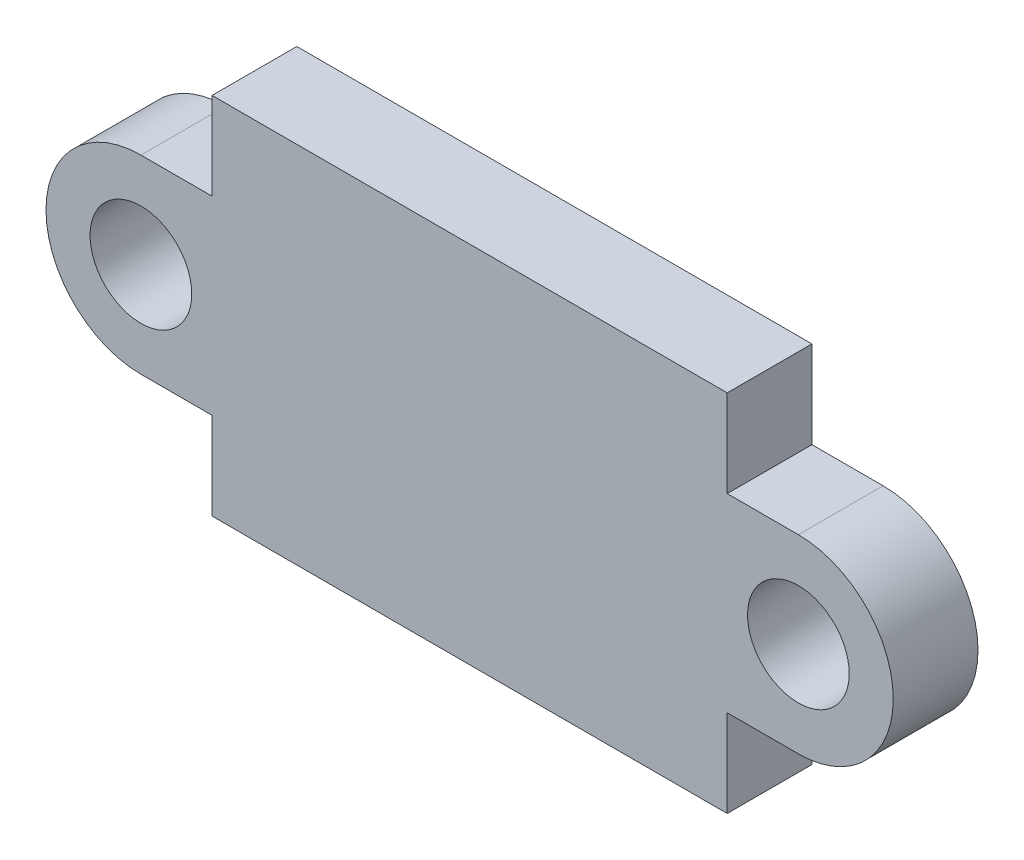
ISO-10303-21;
HEADER;
FILE_DESCRIPTION(('STEP AP214'),'2;1');
FILE_NAME('part.step','',(''),(''),'','','');
FILE_SCHEMA(('AUTOMOTIVE_DESIGN { 1 0 10303 214 1 1 1 1 }'));
ENDSEC;
DATA;
#1=APPLICATION_CONTEXT('core data for automotive mechanical design processes');
#2=APPLICATION_PROTOCOL_DEFINITION('international standard','automotive_design',2000,#1);
#3=PRODUCT_CONTEXT('',#1,'mechanical');
#4=PRODUCT('Part','Part','',(#3));
#5=PRODUCT_RELATED_PRODUCT_CATEGORY('part','',(#4));
#6=PRODUCT_DEFINITION_FORMATION('','',#4);
#7=PRODUCT_DEFINITION_CONTEXT('part definition',#1,'design');
#8=PRODUCT_DEFINITION('design','',#6,#7);
#9=PRODUCT_DEFINITION_SHAPE('','',#8);
#10=(LENGTH_UNIT() NAMED_UNIT(*) SI_UNIT(.MILLI.,.METRE.));
#11=(NAMED_UNIT(*) PLANE_ANGLE_UNIT() SI_UNIT($,.RADIAN.));
#12=(NAMED_UNIT(*) SI_UNIT($,.STERADIAN.) SOLID_ANGLE_UNIT());
#13=UNCERTAINTY_MEASURE_WITH_UNIT(LENGTH_MEASURE(1.E-05),#10,'distance_accuracy_value','');
#14=(GEOMETRIC_REPRESENTATION_CONTEXT(3) GLOBAL_UNCERTAINTY_ASSIGNED_CONTEXT((#13)) GLOBAL_UNIT_ASSIGNED_CONTEXT((#10,
#11,#12)) REPRESENTATION_CONTEXT('',''));
#15=CARTESIAN_POINT('',(0.,0.,0.));
#16=DIRECTION('',(0.,0.,1.));
#17=DIRECTION('',(1.,0.,0.));
#18=AXIS2_PLACEMENT_3D('',#15,#16,#17);
#19=CARTESIAN_POINT('',(-7.6,-5.375,2.5));
#20=DIRECTION('',(0.,1.,0.));
#21=DIRECTION('',(0.,0.,1.));
#22=AXIS2_PLACEMENT_3D('',#19,#20,#21);
#23=PLANE('',#22);
#24=DIRECTION('',(1.,0.,0.));
#25=VECTOR('',#24,1.);
#26=CARTESIAN_POINT('',(-7.6,-5.375,0.));
#27=LINE('',#26,#25);
#28=CARTESIAN_POINT('',(-7.6,-5.375,0.));
#29=VERTEX_POINT('',#28);
#30=CARTESIAN_POINT('',(7.6,-5.375,0.));
#31=VERTEX_POINT('',#30);
#32=EDGE_CURVE('E158',#29,#31,#27,.T.);
#33=ORIENTED_EDGE('',*,*,#32,.T.);
#34=DIRECTION('',(0.,0.,-1.));
#35=VECTOR('',#34,1.);
#36=CARTESIAN_POINT('',(7.6,-5.375,2.5));
#37=LINE('',#36,#35);
#38=CARTESIAN_POINT('',(7.6,-5.375,2.5));
#39=VERTEX_POINT('',#38);
#40=EDGE_CURVE('E11',#39,#31,#37,.T.);
#41=ORIENTED_EDGE('',*,*,#40,.F.);
#42=DIRECTION('',(1.,0.,0.));
#43=VECTOR('',#42,1.);
#44=CARTESIAN_POINT('',(-7.6,-5.375,2.5));
#45=LINE('',#44,#43);
#46=CARTESIAN_POINT('',(-7.6,-5.375,2.5));
#47=VERTEX_POINT('',#46);
#48=EDGE_CURVE('E181',#47,#39,#45,.T.);
#49=ORIENTED_EDGE('',*,*,#48,.F.);
#50=DIRECTION('',(0.,0.,-1.));
#51=VECTOR('',#50,1.);
#52=CARTESIAN_POINT('',(-7.6,-5.375,2.5));
#53=LINE('',#52,#51);
#54=EDGE_CURVE('E154',#47,#29,#53,.T.);
#55=ORIENTED_EDGE('',*,*,#54,.T.);
#56=EDGE_LOOP('',(#33,#41,#49,#55));
#57=FACE_BOUND('',#56,.T.);
#58=ADVANCED_FACE('F38',(#57),#23,.F.);
#59=CARTESIAN_POINT('',(7.6,-2.8,2.5));
#60=DIRECTION('',(-1.,0.,0.));
#61=DIRECTION('',(0.,-1.,0.));
#62=AXIS2_PLACEMENT_3D('',#59,#60,#61);
#63=PLANE('',#62);
#64=DIRECTION('',(0.,1.,0.));
#65=VECTOR('',#64,1.);
#66=CARTESIAN_POINT('',(7.6,-2.8,0.));
#67=LINE('',#66,#65);
#68=CARTESIAN_POINT('',(7.6,-2.8,0.));
#69=VERTEX_POINT('',#68);
#70=EDGE_CURVE('E161',#31,#69,#67,.T.);
#71=ORIENTED_EDGE('',*,*,#70,.T.);
#72=DIRECTION('',(0.,0.,-1.));
#73=VECTOR('',#72,1.);
#74=CARTESIAN_POINT('',(7.6,-2.8,2.5));
#75=LINE('',#74,#73);
#76=CARTESIAN_POINT('',(7.6,-2.8,2.5));
#77=VERTEX_POINT('',#76);
#78=EDGE_CURVE('E46',#77,#69,#75,.T.);
#79=ORIENTED_EDGE('',*,*,#78,.F.);
#80=DIRECTION('',(0.,1.,0.));
#81=VECTOR('',#80,1.);
#82=CARTESIAN_POINT('',(7.6,-2.8,2.5));
#83=LINE('',#82,#81);
#84=EDGE_CURVE('E109',#39,#77,#83,.T.);
#85=ORIENTED_EDGE('',*,*,#84,.F.);
#86=ORIENTED_EDGE('',*,*,#40,.T.);
#87=EDGE_LOOP('',(#71,#79,#85,#86));
#88=FACE_BOUND('',#87,.T.);
#89=ADVANCED_FACE('F260',(#88),#63,.F.);
#90=CARTESIAN_POINT('',(9.7,-2.8,2.5));
#91=DIRECTION('',(0.,1.,0.));
#92=DIRECTION('',(-1.,0.,0.));
#93=AXIS2_PLACEMENT_3D('',#90,#91,#92);
#94=PLANE('',#93);
#95=DIRECTION('',(1.,0.,0.));
#96=VECTOR('',#95,1.);
#97=CARTESIAN_POINT('',(9.7,-2.8,0.));
#98=LINE('',#97,#96);
#99=CARTESIAN_POINT('',(9.7,-2.8,0.));
#100=VERTEX_POINT('',#99);
#101=EDGE_CURVE('E164',#69,#100,#98,.T.);
#102=ORIENTED_EDGE('',*,*,#101,.T.);
#103=DIRECTION('',(0.,0.,-1.));
#104=VECTOR('',#103,1.);
#105=CARTESIAN_POINT('',(9.7,-2.8,2.5));
#106=LINE('',#105,#104);
#107=CARTESIAN_POINT('',(9.7,-2.8,2.5));
#108=VERTEX_POINT('',#107);
#109=EDGE_CURVE('E200',#108,#100,#106,.T.);
#110=ORIENTED_EDGE('',*,*,#109,.F.);
#111=DIRECTION('',(1.,0.,0.));
#112=VECTOR('',#111,1.);
#113=CARTESIAN_POINT('',(9.7,-2.8,2.5));
#114=LINE('',#113,#112);
#115=EDGE_CURVE('E208',#77,#108,#114,.T.);
#116=ORIENTED_EDGE('',*,*,#115,.F.);
#117=ORIENTED_EDGE('',*,*,#78,.T.);
#118=EDGE_LOOP('',(#102,#110,#116,#117));
#119=FACE_BOUND('',#118,.T.);
#120=ADVANCED_FACE('F206',(#119),#94,.F.);
#121=CARTESIAN_POINT('',(9.7,0.,2.5));
#122=DIRECTION('',(0.,0.,-1.));
#123=DIRECTION('',(-1.,0.,0.));
#124=AXIS2_PLACEMENT_3D('',#121,#122,#123);
#125=CYLINDRICAL_SURFACE('',#124,2.8);
#126=CARTESIAN_POINT('',(9.7,0.,0.));
#127=DIRECTION('',(0.,0.,1.));
#128=DIRECTION('',(1.,0.,0.));
#129=AXIS2_PLACEMENT_3D('',#126,#127,#128);
#130=CIRCLE('',#129,2.8);
#131=CARTESIAN_POINT('',(9.7,2.8,0.));
#132=VERTEX_POINT('',#131);
#133=EDGE_CURVE('E166',#100,#132,#130,.T.);
#134=ORIENTED_EDGE('',*,*,#133,.T.);
#135=DIRECTION('',(0.,0.,-1.));
#136=VECTOR('',#135,1.);
#137=CARTESIAN_POINT('',(9.7,2.8,2.5));
#138=LINE('',#137,#136);
#139=CARTESIAN_POINT('',(9.7,2.8,2.5));
#140=VERTEX_POINT('',#139);
#141=EDGE_CURVE('E197',#140,#132,#138,.T.);
#142=ORIENTED_EDGE('',*,*,#141,.F.);
#143=CARTESIAN_POINT('',(9.7,0.,2.5));
#144=DIRECTION('',(0.,0.,1.));
#145=DIRECTION('',(1.,0.,0.));
#146=AXIS2_PLACEMENT_3D('',#143,#144,#145);
#147=CIRCLE('',#146,2.8);
#148=EDGE_CURVE('E226',#108,#140,#147,.T.);
#149=ORIENTED_EDGE('',*,*,#148,.F.);
#150=ORIENTED_EDGE('',*,*,#109,.T.);
#151=EDGE_LOOP('',(#134,#142,#149,#150));
#152=FACE_BOUND('',#151,.T.);
#153=ADVANCED_FACE('F217',(#152),#125,.T.);
#154=CARTESIAN_POINT('',(9.7,2.8,2.5));
#155=DIRECTION('',(0.,-1.,0.));
#156=DIRECTION('',(0.,0.,-1.));
#157=AXIS2_PLACEMENT_3D('',#154,#155,#156);
#158=PLANE('',#157);
#159=DIRECTION('',(-1.,0.,0.));
#160=VECTOR('',#159,1.);
#161=CARTESIAN_POINT('',(9.7,2.8,0.));
#162=LINE('',#161,#160);
#163=CARTESIAN_POINT('',(7.6,2.8,0.));
#164=VERTEX_POINT('',#163);
#165=EDGE_CURVE('E168',#132,#164,#162,.T.);
#166=ORIENTED_EDGE('',*,*,#165,.T.);
#167=DIRECTION('',(0.,0.,-1.));
#168=VECTOR('',#167,1.);
#169=CARTESIAN_POINT('',(7.6,2.8,2.5));
#170=LINE('',#169,#168);
#171=CARTESIAN_POINT('',(7.6,2.8,2.5));
#172=VERTEX_POINT('',#171);
#173=EDGE_CURVE('E194',#172,#164,#170,.T.);
#174=ORIENTED_EDGE('',*,*,#173,.F.);
#175=DIRECTION('',(-1.,0.,0.));
#176=VECTOR('',#175,1.);
#177=CARTESIAN_POINT('',(9.7,2.8,2.5));
#178=LINE('',#177,#176);
#179=EDGE_CURVE('E223',#140,#172,#178,.T.);
#180=ORIENTED_EDGE('',*,*,#179,.F.);
#181=ORIENTED_EDGE('',*,*,#141,.T.);
#182=EDGE_LOOP('',(#166,#174,#180,#181));
#183=FACE_BOUND('',#182,.T.);
#184=ADVANCED_FACE('F221',(#183),#158,.F.);
#185=CARTESIAN_POINT('',(7.6,5.375,2.5));
#186=DIRECTION('',(-1.,0.,0.));
#187=DIRECTION('',(0.,0.,1.));
#188=AXIS2_PLACEMENT_3D('',#185,#186,#187);
#189=PLANE('',#188);
#190=DIRECTION('',(0.,1.,0.));
#191=VECTOR('',#190,1.);
#192=CARTESIAN_POINT('',(7.6,5.375,0.));
#193=LINE('',#192,#191);
#194=CARTESIAN_POINT('',(7.6,5.375,0.));
#195=VERTEX_POINT('',#194);
#196=EDGE_CURVE('E170',#164,#195,#193,.T.);
#197=ORIENTED_EDGE('',*,*,#196,.T.);
#198=DIRECTION('',(0.,0.,-1.));
#199=VECTOR('',#198,1.);
#200=CARTESIAN_POINT('',(7.6,5.375,2.5));
#201=LINE('',#200,#199);
#202=CARTESIAN_POINT('',(7.6,5.375,2.5));
#203=VERTEX_POINT('',#202);
#204=EDGE_CURVE('E191',#203,#195,#201,.T.);
#205=ORIENTED_EDGE('',*,*,#204,.F.);
#206=DIRECTION('',(0.,1.,0.));
#207=VECTOR('',#206,1.);
#208=CARTESIAN_POINT('',(7.6,5.375,2.5));
#209=LINE('',#208,#207);
#210=EDGE_CURVE('E225',#172,#203,#209,.T.);
#211=ORIENTED_EDGE('',*,*,#210,.F.);
#212=ORIENTED_EDGE('',*,*,#173,.T.);
#213=EDGE_LOOP('',(#197,#205,#211,#212));
#214=FACE_BOUND('',#213,.T.);
#215=ADVANCED_FACE('F273',(#214),#189,.F.);
#216=CARTESIAN_POINT('',(-7.6,5.375,2.5));
#217=DIRECTION('',(0.,-1.,0.));
#218=DIRECTION('',(0.,0.,-1.));
#219=AXIS2_PLACEMENT_3D('',#216,#217,#218);
#220=PLANE('',#219);
#221=DIRECTION('',(-1.,0.,0.));
#222=VECTOR('',#221,1.);
#223=CARTESIAN_POINT('',(-7.6,5.375,0.));
#224=LINE('',#223,#222);
#225=CARTESIAN_POINT('',(-7.6,5.375,0.));
#226=VERTEX_POINT('',#225);
#227=EDGE_CURVE('E172',#195,#226,#224,.T.);
#228=ORIENTED_EDGE('',*,*,#227,.T.);
#229=DIRECTION('',(0.,0.,-1.));
#230=VECTOR('',#229,1.);
#231=CARTESIAN_POINT('',(-7.6,5.375,2.5));
#232=LINE('',#231,#230);
#233=CARTESIAN_POINT('',(-7.6,5.375,2.5));
#234=VERTEX_POINT('',#233);
#235=EDGE_CURVE('E188',#234,#226,#232,.T.);
#236=ORIENTED_EDGE('',*,*,#235,.F.);
#237=DIRECTION('',(-1.,0.,0.));
#238=VECTOR('',#237,1.);
#239=CARTESIAN_POINT('',(-7.6,5.375,2.5));
#240=LINE('',#239,#238);
#241=EDGE_CURVE('E228',#203,#234,#240,.T.);
#242=ORIENTED_EDGE('',*,*,#241,.F.);
#243=ORIENTED_EDGE('',*,*,#204,.T.);
#244=EDGE_LOOP('',(#228,#236,#242,#243));
#245=FACE_BOUND('',#244,.T.);
#246=ADVANCED_FACE('F276',(#245),#220,.F.);
#247=CARTESIAN_POINT('',(-7.6,5.375,2.5));
#248=DIRECTION('',(1.,0.,0.));
#249=DIRECTION('',(0.,0.,-1.));
#250=AXIS2_PLACEMENT_3D('',#247,#248,#249);
#251=PLANE('',#250);
#252=DIRECTION('',(0.,-1.,0.));
#253=VECTOR('',#252,1.);
#254=CARTESIAN_POINT('',(-7.6,5.375,0.));
#255=LINE('',#254,#253);
#256=CARTESIAN_POINT('',(-7.6,2.8,0.));
#257=VERTEX_POINT('',#256);
#258=EDGE_CURVE('E174',#226,#257,#255,.T.);
#259=ORIENTED_EDGE('',*,*,#258,.T.);
#260=DIRECTION('',(0.,0.,-1.));
#261=VECTOR('',#260,1.);
#262=CARTESIAN_POINT('',(-7.6,2.8,2.5));
#263=LINE('',#262,#261);
#264=CARTESIAN_POINT('',(-7.6,2.8,2.5));
#265=VERTEX_POINT('',#264);
#266=EDGE_CURVE('E185',#265,#257,#263,.T.);
#267=ORIENTED_EDGE('',*,*,#266,.F.);
#268=DIRECTION('',(0.,-1.,0.));
#269=VECTOR('',#268,1.);
#270=CARTESIAN_POINT('',(-7.6,5.375,2.5));
#271=LINE('',#270,#269);
#272=EDGE_CURVE('E234',#234,#265,#271,.T.);
#273=ORIENTED_EDGE('',*,*,#272,.F.);
#274=ORIENTED_EDGE('',*,*,#235,.T.);
#275=EDGE_LOOP('',(#259,#267,#273,#274));
#276=FACE_BOUND('',#275,.T.);
#277=ADVANCED_FACE('F240',(#276),#251,.F.);
#278=CARTESIAN_POINT('',(-9.7,2.8,2.5));
#279=DIRECTION('',(0.,-1.,0.));
#280=DIRECTION('',(0.,0.,-1.));
#281=AXIS2_PLACEMENT_3D('',#278,#279,#280);
#282=PLANE('',#281);
#283=DIRECTION('',(-1.,0.,0.));
#284=VECTOR('',#283,1.);
#285=CARTESIAN_POINT('',(-9.7,2.8,0.));
#286=LINE('',#285,#284);
#287=CARTESIAN_POINT('',(-9.7,2.8,0.));
#288=VERTEX_POINT('',#287);
#289=EDGE_CURVE('E176',#257,#288,#286,.T.);
#290=ORIENTED_EDGE('',*,*,#289,.T.);
#291=DIRECTION('',(0.,0.,-1.));
#292=VECTOR('',#291,1.);
#293=CARTESIAN_POINT('',(-9.7,2.8,2.5));
#294=LINE('',#293,#292);
#295=CARTESIAN_POINT('',(-9.7,2.8,2.5));
#296=VERTEX_POINT('',#295);
#297=EDGE_CURVE('E149',#296,#288,#294,.T.);
#298=ORIENTED_EDGE('',*,*,#297,.F.);
#299=DIRECTION('',(-1.,0.,0.));
#300=VECTOR('',#299,1.);
#301=CARTESIAN_POINT('',(-9.7,2.8,2.5));
#302=LINE('',#301,#300);
#303=EDGE_CURVE('E140',#265,#296,#302,.T.);
#304=ORIENTED_EDGE('',*,*,#303,.F.);
#305=ORIENTED_EDGE('',*,*,#266,.T.);
#306=EDGE_LOOP('',(#290,#298,#304,#305));
#307=FACE_BOUND('',#306,.T.);
#308=ADVANCED_FACE('F244',(#307),#282,.F.);
#309=CARTESIAN_POINT('',(-9.7,0.,2.5));
#310=DIRECTION('',(0.,0.,-1.));
#311=DIRECTION('',(-1.,0.,0.));
#312=AXIS2_PLACEMENT_3D('',#309,#310,#311);
#313=CYLINDRICAL_SURFACE('',#312,2.8);
#314=CARTESIAN_POINT('',(-9.7,0.,0.));
#315=DIRECTION('',(0.,0.,1.));
#316=DIRECTION('',(1.,0.,0.));
#317=AXIS2_PLACEMENT_3D('',#314,#315,#316);
#318=CIRCLE('',#317,2.8);
#319=CARTESIAN_POINT('',(-9.7,-2.8,0.));
#320=VERTEX_POINT('',#319);
#321=EDGE_CURVE('E148',#288,#320,#318,.T.);
#322=ORIENTED_EDGE('',*,*,#321,.T.);
#323=DIRECTION('',(0.,0.,-1.));
#324=VECTOR('',#323,1.);
#325=CARTESIAN_POINT('',(-9.7,-2.8,2.5));
#326=LINE('',#325,#324);
#327=CARTESIAN_POINT('',(-9.7,-2.8,2.5));
#328=VERTEX_POINT('',#327);
#329=EDGE_CURVE('E145',#328,#320,#326,.T.);
#330=ORIENTED_EDGE('',*,*,#329,.F.);
#331=CARTESIAN_POINT('',(-9.7,0.,2.5));
#332=DIRECTION('',(0.,0.,1.));
#333=DIRECTION('',(1.,0.,0.));
#334=AXIS2_PLACEMENT_3D('',#331,#332,#333);
#335=CIRCLE('',#334,2.8);
#336=EDGE_CURVE('E134',#296,#328,#335,.T.);
#337=ORIENTED_EDGE('',*,*,#336,.F.);
#338=ORIENTED_EDGE('',*,*,#297,.T.);
#339=EDGE_LOOP('',(#322,#330,#337,#338));
#340=FACE_BOUND('',#339,.T.);
#341=ADVANCED_FACE('F146',(#340),#313,.T.);
#342=CARTESIAN_POINT('',(-9.7,-2.8,2.5));
#343=DIRECTION('',(0.,1.,0.));
#344=DIRECTION('',(0.,0.,1.));
#345=AXIS2_PLACEMENT_3D('',#342,#343,#344);
#346=PLANE('',#345);
#347=DIRECTION('',(1.,0.,0.));
#348=VECTOR('',#347,1.);
#349=CARTESIAN_POINT('',(-9.7,-2.8,0.));
#350=LINE('',#349,#348);
#351=CARTESIAN_POINT('',(-7.6,-2.8,0.));
#352=VERTEX_POINT('',#351);
#353=EDGE_CURVE('E95',#320,#352,#350,.T.);
#354=ORIENTED_EDGE('',*,*,#353,.T.);
#355=DIRECTION('',(0.,0.,-1.));
#356=VECTOR('',#355,1.);
#357=CARTESIAN_POINT('',(-7.6,-2.8,2.5));
#358=LINE('',#357,#356);
#359=CARTESIAN_POINT('',(-7.6,-2.8,2.5));
#360=VERTEX_POINT('',#359);
#361=EDGE_CURVE('E150',#360,#352,#358,.T.);
#362=ORIENTED_EDGE('',*,*,#361,.F.);
#363=DIRECTION('',(1.,0.,0.));
#364=VECTOR('',#363,1.);
#365=CARTESIAN_POINT('',(-9.7,-2.8,2.5));
#366=LINE('',#365,#364);
#367=EDGE_CURVE('E138',#328,#360,#366,.T.);
#368=ORIENTED_EDGE('',*,*,#367,.F.);
#369=ORIENTED_EDGE('',*,*,#329,.T.);
#370=EDGE_LOOP('',(#354,#362,#368,#369));
#371=FACE_BOUND('',#370,.T.);
#372=ADVANCED_FACE('F152',(#371),#346,.F.);
#373=CARTESIAN_POINT('',(-7.6,-2.8,2.5));
#374=DIRECTION('',(1.,0.,0.));
#375=DIRECTION('',(0.,1.,0.));
#376=AXIS2_PLACEMENT_3D('',#373,#374,#375);
#377=PLANE('',#376);
#378=DIRECTION('',(0.,-1.,0.));
#379=VECTOR('',#378,1.);
#380=CARTESIAN_POINT('',(-7.6,-2.8,0.));
#381=LINE('',#380,#379);
#382=EDGE_CURVE('E101',#352,#29,#381,.T.);
#383=ORIENTED_EDGE('',*,*,#382,.T.);
#384=ORIENTED_EDGE('',*,*,#54,.F.);
#385=DIRECTION('',(0.,-1.,0.));
#386=VECTOR('',#385,1.);
#387=CARTESIAN_POINT('',(-7.6,-2.8,2.5));
#388=LINE('',#387,#386);
#389=EDGE_CURVE('E54',#360,#47,#388,.T.);
#390=ORIENTED_EDGE('',*,*,#389,.F.);
#391=ORIENTED_EDGE('',*,*,#361,.T.);
#392=EDGE_LOOP('',(#383,#384,#390,#391));
#393=FACE_BOUND('',#392,.T.);
#394=ADVANCED_FACE('F248',(#393),#377,.F.);
#395=CARTESIAN_POINT('',(9.7,0.,2.5));
#396=DIRECTION('',(0.,0.,1.));
#397=DIRECTION('',(1.,0.,0.));
#398=AXIS2_PLACEMENT_3D('',#395,#396,#397);
#399=PLANE('',#398);
#400=CARTESIAN_POINT('',(-9.7,0.,2.5));
#401=DIRECTION('',(0.,0.,1.));
#402=DIRECTION('',(1.,0.,0.));
#403=AXIS2_PLACEMENT_3D('',#400,#401,#402);
#404=CIRCLE('',#403,1.5);
#405=CARTESIAN_POINT('',(-8.2,0.,2.5));
#406=VERTEX_POINT('',#405);
#407=EDGE_CURVE('E342',#406,#406,#404,.T.);
#408=ORIENTED_EDGE('',*,*,#407,.F.);
#409=EDGE_LOOP('',(#408));
#410=FACE_BOUND('',#409,.T.);
#411=CARTESIAN_POINT('',(9.7,0.,2.5));
#412=DIRECTION('',(0.,0.,1.));
#413=DIRECTION('',(1.,0.,0.));
#414=AXIS2_PLACEMENT_3D('',#411,#412,#413);
#415=CIRCLE('',#414,1.5);
#416=CARTESIAN_POINT('',(11.2,0.,2.5));
#417=VERTEX_POINT('',#416);
#418=EDGE_CURVE('E347',#417,#417,#415,.T.);
#419=ORIENTED_EDGE('',*,*,#418,.F.);
#420=EDGE_LOOP('',(#419));
#421=FACE_BOUND('',#420,.T.);
#422=ORIENTED_EDGE('',*,*,#48,.T.);
#423=ORIENTED_EDGE('',*,*,#84,.T.);
#424=ORIENTED_EDGE('',*,*,#115,.T.);
#425=ORIENTED_EDGE('',*,*,#148,.T.);
#426=ORIENTED_EDGE('',*,*,#179,.T.);
#427=ORIENTED_EDGE('',*,*,#210,.T.);
#428=ORIENTED_EDGE('',*,*,#241,.T.);
#429=ORIENTED_EDGE('',*,*,#272,.T.);
#430=ORIENTED_EDGE('',*,*,#303,.T.);
#431=ORIENTED_EDGE('',*,*,#336,.T.);
#432=ORIENTED_EDGE('',*,*,#367,.T.);
#433=ORIENTED_EDGE('',*,*,#389,.T.);
#434=EDGE_LOOP('',(#422,#423,#424,#425,#426,#427,#428,#429,#430,#431,#432,#433));
#435=FACE_BOUND('',#434,.T.);
#436=ADVANCED_FACE('F136',(#410,#421,#435),#399,.T.);
#437=CARTESIAN_POINT('',(9.7,0.,0.));
#438=DIRECTION('',(0.,0.,1.));
#439=DIRECTION('',(1.,0.,0.));
#440=AXIS2_PLACEMENT_3D('',#437,#438,#439);
#441=PLANE('',#440);
#442=CARTESIAN_POINT('',(-9.7,0.,0.));
#443=DIRECTION('',(0.,0.,1.));
#444=DIRECTION('',(1.,0.,0.));
#445=AXIS2_PLACEMENT_3D('',#442,#443,#444);
#446=CIRCLE('',#445,1.5);
#447=CARTESIAN_POINT('',(-8.2,0.,0.));
#448=VERTEX_POINT('',#447);
#449=EDGE_CURVE('E162',#448,#448,#446,.T.);
#450=ORIENTED_EDGE('',*,*,#449,.T.);
#451=EDGE_LOOP('',(#450));
#452=FACE_BOUND('',#451,.T.);
#453=CARTESIAN_POINT('',(9.7,0.,0.));
#454=DIRECTION('',(0.,0.,1.));
#455=DIRECTION('',(1.,0.,0.));
#456=AXIS2_PLACEMENT_3D('',#453,#454,#455);
#457=CIRCLE('',#456,1.5);
#458=CARTESIAN_POINT('',(11.2,0.,0.));
#459=VERTEX_POINT('',#458);
#460=EDGE_CURVE('E343',#459,#459,#457,.T.);
#461=ORIENTED_EDGE('',*,*,#460,.T.);
#462=EDGE_LOOP('',(#461));
#463=FACE_BOUND('',#462,.T.);
#464=ORIENTED_EDGE('',*,*,#32,.F.);
#465=ORIENTED_EDGE('',*,*,#382,.F.);
#466=ORIENTED_EDGE('',*,*,#353,.F.);
#467=ORIENTED_EDGE('',*,*,#321,.F.);
#468=ORIENTED_EDGE('',*,*,#289,.F.);
#469=ORIENTED_EDGE('',*,*,#258,.F.);
#470=ORIENTED_EDGE('',*,*,#227,.F.);
#471=ORIENTED_EDGE('',*,*,#196,.F.);
#472=ORIENTED_EDGE('',*,*,#165,.F.);
#473=ORIENTED_EDGE('',*,*,#133,.F.);
#474=ORIENTED_EDGE('',*,*,#101,.F.);
#475=ORIENTED_EDGE('',*,*,#70,.F.);
#476=EDGE_LOOP('',(#464,#465,#466,#467,#468,#469,#470,#471,#472,#473,#474,#475));
#477=FACE_BOUND('',#476,.T.);
#478=ADVANCED_FACE('F212',(#452,#463,#477),#441,.F.);
#479=CARTESIAN_POINT('',(9.7,0.,0.));
#480=DIRECTION('',(0.,0.,1.));
#481=DIRECTION('',(1.,0.,0.));
#482=AXIS2_PLACEMENT_3D('',#479,#480,#481);
#483=CYLINDRICAL_SURFACE('',#482,1.5);
#484=ORIENTED_EDGE('',*,*,#460,.F.);
#485=EDGE_LOOP('',(#484));
#486=FACE_BOUND('',#485,.T.);
#487=ORIENTED_EDGE('',*,*,#418,.T.);
#488=EDGE_LOOP('',(#487));
#489=FACE_BOUND('',#488,.T.);
#490=ADVANCED_FACE('F314',(#486,#489),#483,.F.);
#491=CARTESIAN_POINT('',(-9.7,0.,0.));
#492=DIRECTION('',(0.,0.,1.));
#493=DIRECTION('',(1.,0.,0.));
#494=AXIS2_PLACEMENT_3D('',#491,#492,#493);
#495=CYLINDRICAL_SURFACE('',#494,1.5);
#496=ORIENTED_EDGE('',*,*,#449,.F.);
#497=EDGE_LOOP('',(#496));
#498=FACE_BOUND('',#497,.T.);
#499=ORIENTED_EDGE('',*,*,#407,.T.);
#500=EDGE_LOOP('',(#499));
#501=FACE_BOUND('',#500,.T.);
#502=ADVANCED_FACE('F323',(#498,#501),#495,.F.);
#503=CLOSED_SHELL('',(#58,#89,#120,#153,#184,#215,#246,#277,#308,#341,#372,#394,#436,#478,#490,#502));
#504=MANIFOLD_SOLID_BREP('B2',#503);
#505=ADVANCED_BREP_SHAPE_REPRESENTATION('',(#18,#504),#14);
#506=SHAPE_DEFINITION_REPRESENTATION(#9,#505);
ENDSEC;
END-ISO-10303-21;
